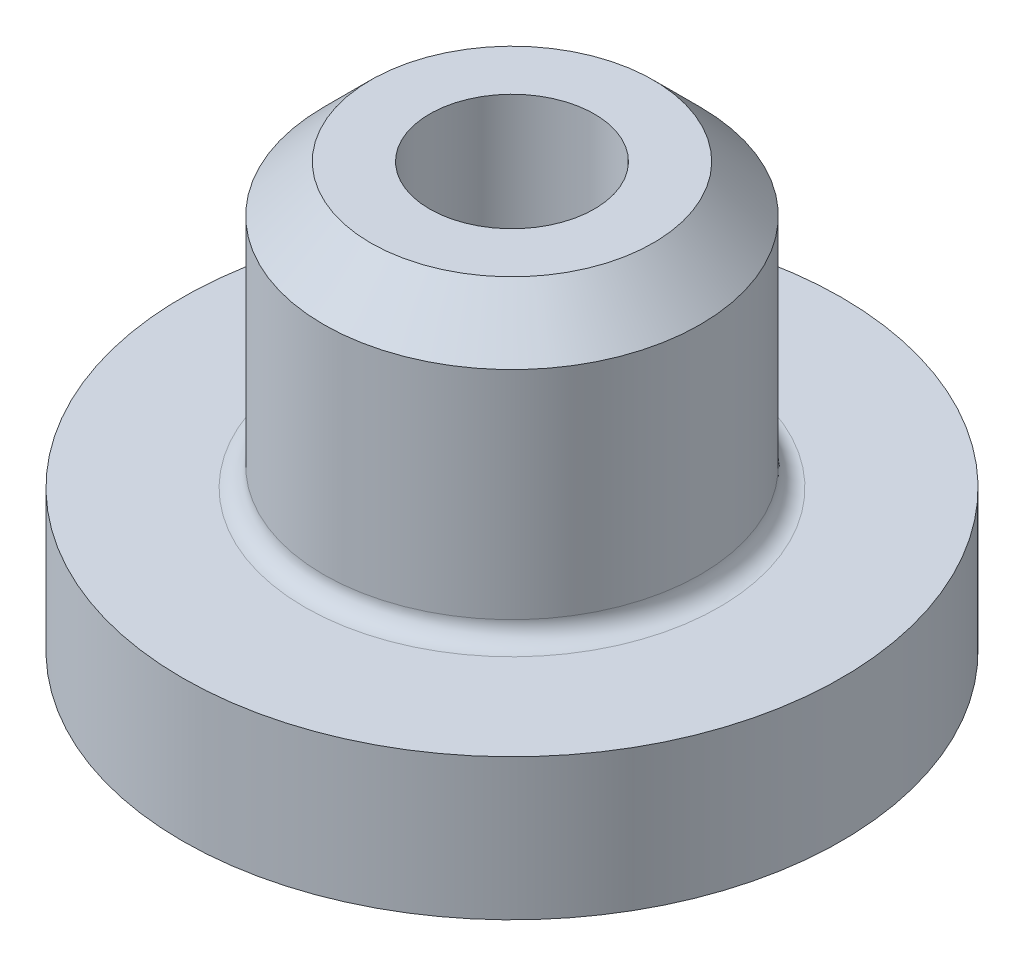
ISO-10303-21;
HEADER;
FILE_DESCRIPTION(('STEP AP214'),'2;1');
FILE_NAME('part.step','',(''),(''),'','','');
FILE_SCHEMA(('AUTOMOTIVE_DESIGN { 1 0 10303 214 1 1 1 1 }'));
ENDSEC;
DATA;
#1=APPLICATION_CONTEXT('core data for automotive mechanical design processes');
#2=APPLICATION_PROTOCOL_DEFINITION('international standard','automotive_design',2000,#1);
#3=PRODUCT_CONTEXT('',#1,'mechanical');
#4=PRODUCT('Part','Part','',(#3));
#5=PRODUCT_RELATED_PRODUCT_CATEGORY('part','',(#4));
#6=PRODUCT_DEFINITION_FORMATION('','',#4);
#7=PRODUCT_DEFINITION_CONTEXT('part definition',#1,'design');
#8=PRODUCT_DEFINITION('design','',#6,#7);
#9=PRODUCT_DEFINITION_SHAPE('','',#8);
#10=(LENGTH_UNIT() NAMED_UNIT(*) SI_UNIT(.MILLI.,.METRE.));
#11=(NAMED_UNIT(*) PLANE_ANGLE_UNIT() SI_UNIT($,.RADIAN.));
#12=(NAMED_UNIT(*) SI_UNIT($,.STERADIAN.) SOLID_ANGLE_UNIT());
#13=UNCERTAINTY_MEASURE_WITH_UNIT(LENGTH_MEASURE(1.E-05),#10,'distance_accuracy_value','');
#14=(GEOMETRIC_REPRESENTATION_CONTEXT(3) GLOBAL_UNCERTAINTY_ASSIGNED_CONTEXT((#13)) GLOBAL_UNIT_ASSIGNED_CONTEXT((#10,
#11,#12)) REPRESENTATION_CONTEXT('',''));
#15=CARTESIAN_POINT('',(0.,0.,0.));
#16=DIRECTION('',(0.,0.,1.));
#17=DIRECTION('',(1.,0.,0.));
#18=AXIS2_PLACEMENT_3D('',#15,#16,#17);
#19=CARTESIAN_POINT('',(0.,2.,0.));
#20=DIRECTION('',(0.,-1.,0.));
#21=DIRECTION('',(0.,0.,-1.));
#22=AXIS2_PLACEMENT_3D('',#19,#20,#21);
#23=CYLINDRICAL_SURFACE('',#22,2.);
#24=CARTESIAN_POINT('',(0.,1.7,0.));
#25=DIRECTION('',(0.,1.,0.));
#26=DIRECTION('',(0.,0.,1.));
#27=AXIS2_PLACEMENT_3D('',#24,#25,#26);
#28=CIRCLE('',#27,2.);
#29=CARTESIAN_POINT('',(0.,1.7,2.));
#30=VERTEX_POINT('',#29);
#31=EDGE_CURVE('E56',#30,#30,#28,.T.);
#32=ORIENTED_EDGE('',*,*,#31,.T.);
#33=EDGE_LOOP('',(#32));
#34=FACE_BOUND('',#33,.T.);
#35=CARTESIAN_POINT('',(0.,4.,0.));
#36=DIRECTION('',(0.,1.,0.));
#37=DIRECTION('',(0.,0.,1.));
#38=AXIS2_PLACEMENT_3D('',#35,#36,#37);
#39=CIRCLE('',#38,2.);
#40=CARTESIAN_POINT('',(0.,4.,2.));
#41=VERTEX_POINT('',#40);
#42=EDGE_CURVE('E65',#41,#41,#39,.F.);
#43=ORIENTED_EDGE('',*,*,#42,.T.);
#44=EDGE_LOOP('',(#43));
#45=FACE_BOUND('',#44,.T.);
#46=ADVANCED_FACE('F36',(#34,#45),#23,.T.);
#47=CARTESIAN_POINT('',(3.5,1.5,0.));
#48=DIRECTION('',(0.,1.,0.));
#49=DIRECTION('',(0.,0.,1.));
#50=AXIS2_PLACEMENT_3D('',#47,#48,#49);
#51=PLANE('',#50);
#52=CARTESIAN_POINT('',(0.,1.5,0.));
#53=DIRECTION('',(0.,1.,0.));
#54=DIRECTION('',(0.,0.,1.));
#55=AXIS2_PLACEMENT_3D('',#52,#53,#54);
#56=CIRCLE('',#55,2.2);
#57=CARTESIAN_POINT('',(0.,1.5,2.2));
#58=VERTEX_POINT('',#57);
#59=EDGE_CURVE('E59',#58,#58,#56,.F.);
#60=ORIENTED_EDGE('',*,*,#59,.T.);
#61=EDGE_LOOP('',(#60));
#62=FACE_BOUND('',#61,.T.);
#63=CARTESIAN_POINT('',(0.,1.5,0.));
#64=DIRECTION('',(0.,-1.,0.));
#65=DIRECTION('',(0.,0.,-1.));
#66=AXIS2_PLACEMENT_3D('',#63,#64,#65);
#67=CIRCLE('',#66,3.5);
#68=CARTESIAN_POINT('',(0.,1.5,-3.5));
#69=VERTEX_POINT('',#68);
#70=EDGE_CURVE('E68',#69,#69,#67,.T.);
#71=ORIENTED_EDGE('',*,*,#70,.F.);
#72=EDGE_LOOP('',(#71));
#73=FACE_BOUND('',#72,.T.);
#74=ADVANCED_FACE('F98',(#62,#73),#51,.T.);
#75=CARTESIAN_POINT('',(0.,2.,0.));
#76=DIRECTION('',(0.,-1.,0.));
#77=DIRECTION('',(0.,0.,-1.));
#78=AXIS2_PLACEMENT_3D('',#75,#76,#77);
#79=CYLINDRICAL_SURFACE('',#78,3.5);
#80=ORIENTED_EDGE('',*,*,#70,.T.);
#81=EDGE_LOOP('',(#80));
#82=FACE_BOUND('',#81,.T.);
#83=CARTESIAN_POINT('',(0.,0.,0.));
#84=DIRECTION('',(0.,-1.,0.));
#85=DIRECTION('',(0.,0.,-1.));
#86=AXIS2_PLACEMENT_3D('',#83,#84,#85);
#87=CIRCLE('',#86,3.5);
#88=CARTESIAN_POINT('',(0.,0.,-3.5));
#89=VERTEX_POINT('',#88);
#90=EDGE_CURVE('E71',#89,#89,#87,.T.);
#91=ORIENTED_EDGE('',*,*,#90,.F.);
#92=EDGE_LOOP('',(#91));
#93=FACE_BOUND('',#92,.T.);
#94=ADVANCED_FACE('F104',(#82,#93),#79,.T.);
#95=CARTESIAN_POINT('',(3.5,0.,0.));
#96=DIRECTION('',(0.,-1.,0.));
#97=DIRECTION('',(0.,0.,-1.));
#98=AXIS2_PLACEMENT_3D('',#95,#96,#97);
#99=PLANE('',#98);
#100=ORIENTED_EDGE('',*,*,#90,.T.);
#101=EDGE_LOOP('',(#100));
#102=FACE_BOUND('',#101,.T.);
#103=CARTESIAN_POINT('',(0.,0.,0.));
#104=DIRECTION('',(0.,-1.,0.));
#105=DIRECTION('',(0.,0.,-1.));
#106=AXIS2_PLACEMENT_3D('',#103,#104,#105);
#107=CIRCLE('',#106,1.2);
#108=CARTESIAN_POINT('',(0.,0.,-1.2));
#109=VERTEX_POINT('',#108);
#110=EDGE_CURVE('E74',#109,#109,#107,.T.);
#111=ORIENTED_EDGE('',*,*,#110,.F.);
#112=EDGE_LOOP('',(#111));
#113=FACE_BOUND('',#112,.T.);
#114=ADVANCED_FACE('F133',(#102,#113),#99,.T.);
#115=CARTESIAN_POINT('',(0.,2.,0.));
#116=DIRECTION('',(0.,-1.,0.));
#117=DIRECTION('',(0.,0.,-1.));
#118=AXIS2_PLACEMENT_3D('',#115,#116,#117);
#119=CYLINDRICAL_SURFACE('',#118,1.2);
#120=CARTESIAN_POINT('',(0.,1.8,0.));
#121=DIRECTION('',(0.,-1.,0.));
#122=DIRECTION('',(0.,0.,-1.));
#123=AXIS2_PLACEMENT_3D('',#120,#121,#122);
#124=CIRCLE('',#123,1.2);
#125=CARTESIAN_POINT('',(0.,1.8,-1.2));
#126=VERTEX_POINT('',#125);
#127=EDGE_CURVE('E47',#126,#126,#124,.F.);
#128=ORIENTED_EDGE('',*,*,#127,.T.);
#129=EDGE_LOOP('',(#128));
#130=FACE_BOUND('',#129,.T.);
#131=ORIENTED_EDGE('',*,*,#110,.T.);
#132=EDGE_LOOP('',(#131));
#133=FACE_BOUND('',#132,.T.);
#134=ADVANCED_FACE('F94',(#130,#133),#119,.F.);
#135=CARTESIAN_POINT('',(1.2,2.,0.));
#136=DIRECTION('',(0.,-1.,0.));
#137=DIRECTION('',(0.,0.,-1.));
#138=AXIS2_PLACEMENT_3D('',#135,#136,#137);
#139=PLANE('',#138);
#140=CARTESIAN_POINT('',(0.,2.,0.));
#141=DIRECTION('',(0.,-1.,0.));
#142=DIRECTION('',(0.,0.,-1.));
#143=AXIS2_PLACEMENT_3D('',#140,#141,#142);
#144=CIRCLE('',#143,1.);
#145=CARTESIAN_POINT('',(0.,2.,-1.));
#146=VERTEX_POINT('',#145);
#147=EDGE_CURVE('E51',#146,#146,#144,.T.);
#148=ORIENTED_EDGE('',*,*,#147,.T.);
#149=EDGE_LOOP('',(#148));
#150=FACE_BOUND('',#149,.T.);
#151=ADVANCED_FACE('F85',(#150),#139,.T.);
#152=CARTESIAN_POINT('',(0.,4.5,0.));
#153=DIRECTION('',(0.,1.,0.));
#154=DIRECTION('',(0.,0.,1.));
#155=AXIS2_PLACEMENT_3D('',#152,#153,#154);
#156=PLANE('',#155);
#157=CARTESIAN_POINT('',(0.,4.5,0.));
#158=DIRECTION('',(0.,1.,0.));
#159=DIRECTION('',(0.,0.,1.));
#160=AXIS2_PLACEMENT_3D('',#157,#158,#159);
#161=CIRCLE('',#160,1.5);
#162=CARTESIAN_POINT('',(0.,4.5,1.5));
#163=VERTEX_POINT('',#162);
#164=EDGE_CURVE('E62',#163,#163,#161,.T.);
#165=ORIENTED_EDGE('',*,*,#164,.T.);
#166=EDGE_LOOP('',(#165));
#167=FACE_BOUND('',#166,.T.);
#168=CARTESIAN_POINT('',(0.,4.5,0.));
#169=DIRECTION('',(0.,1.,0.));
#170=DIRECTION('',(0.,0.,1.));
#171=AXIS2_PLACEMENT_3D('',#168,#169,#170);
#172=CIRCLE('',#171,0.875);
#173=CARTESIAN_POINT('',(0.,4.5,0.875));
#174=VERTEX_POINT('',#173);
#175=EDGE_CURVE('E77',#174,#174,#172,.T.);
#176=ORIENTED_EDGE('',*,*,#175,.F.);
#177=EDGE_LOOP('',(#176));
#178=FACE_BOUND('',#177,.T.);
#179=ADVANCED_FACE('F83',(#167,#178),#156,.T.);
#180=CARTESIAN_POINT('',(0.,2.5,0.));
#181=DIRECTION('',(0.,1.,0.));
#182=DIRECTION('',(0.,0.,1.));
#183=AXIS2_PLACEMENT_3D('',#180,#181,#182);
#184=CYLINDRICAL_SURFACE('',#183,0.875);
#185=CARTESIAN_POINT('',(0.,2.7,0.));
#186=DIRECTION('',(0.,1.,0.));
#187=DIRECTION('',(0.,0.,1.));
#188=AXIS2_PLACEMENT_3D('',#185,#186,#187);
#189=CIRCLE('',#188,0.875);
#190=CARTESIAN_POINT('',(0.,2.7,0.875));
#191=VERTEX_POINT('',#190);
#192=EDGE_CURVE('E10',#191,#191,#189,.F.);
#193=ORIENTED_EDGE('',*,*,#192,.T.);
#194=EDGE_LOOP('',(#193));
#195=FACE_BOUND('',#194,.T.);
#196=ORIENTED_EDGE('',*,*,#175,.T.);
#197=EDGE_LOOP('',(#196));
#198=FACE_BOUND('',#197,.T.);
#199=ADVANCED_FACE('F81',(#195,#198),#184,.F.);
#200=CARTESIAN_POINT('',(0.,2.5,0.));
#201=DIRECTION('',(0.,1.,0.));
#202=DIRECTION('',(0.,0.,1.));
#203=AXIS2_PLACEMENT_3D('',#200,#201,#202);
#204=PLANE('',#203);
#205=CARTESIAN_POINT('',(0.,2.5,0.));
#206=DIRECTION('',(0.,1.,0.));
#207=DIRECTION('',(0.,0.,1.));
#208=AXIS2_PLACEMENT_3D('',#205,#206,#207);
#209=CIRCLE('',#208,0.675);
#210=CARTESIAN_POINT('',(0.,2.5,0.675));
#211=VERTEX_POINT('',#210);
#212=EDGE_CURVE('E43',#211,#211,#209,.T.);
#213=ORIENTED_EDGE('',*,*,#212,.T.);
#214=EDGE_LOOP('',(#213));
#215=FACE_BOUND('',#214,.T.);
#216=ADVANCED_FACE('F92',(#215),#204,.T.);
#217=CARTESIAN_POINT('',(0.,4.,0.));
#218=DIRECTION('',(0.,-1.,0.));
#219=DIRECTION('',(0.,0.,-1.));
#220=AXIS2_PLACEMENT_3D('',#217,#218,#219);
#221=CONICAL_SURFACE('',#220,2.,0.78539816339745);
#222=ORIENTED_EDGE('',*,*,#164,.F.);
#223=EDGE_LOOP('',(#222));
#224=FACE_BOUND('',#223,.T.);
#225=ORIENTED_EDGE('',*,*,#42,.F.);
#226=EDGE_LOOP('',(#225));
#227=FACE_BOUND('',#226,.T.);
#228=ADVANCED_FACE('F111',(#224,#227),#221,.T.);
#229=CARTESIAN_POINT('',(0.,1.7,0.));
#230=DIRECTION('',(0.,1.,0.));
#231=DIRECTION('',(0.,0.,1.));
#232=AXIS2_PLACEMENT_3D('',#229,#230,#231);
#233=TOROIDAL_SURFACE('',#232,2.2,0.2);
#234=ORIENTED_EDGE('',*,*,#31,.F.);
#235=EDGE_LOOP('',(#234));
#236=FACE_BOUND('',#235,.T.);
#237=ORIENTED_EDGE('',*,*,#59,.F.);
#238=EDGE_LOOP('',(#237));
#239=FACE_BOUND('',#238,.T.);
#240=ADVANCED_FACE('F116',(#236,#239),#233,.F.);
#241=CARTESIAN_POINT('',(0.,1.8,0.));
#242=DIRECTION('',(0.,-1.,0.));
#243=DIRECTION('',(0.,0.,-1.));
#244=AXIS2_PLACEMENT_3D('',#241,#242,#243);
#245=TOROIDAL_SURFACE('',#244,1.,0.2);
#246=ORIENTED_EDGE('',*,*,#127,.F.);
#247=EDGE_LOOP('',(#246));
#248=FACE_BOUND('',#247,.T.);
#249=ORIENTED_EDGE('',*,*,#147,.F.);
#250=EDGE_LOOP('',(#249));
#251=FACE_BOUND('',#250,.T.);
#252=ADVANCED_FACE('F119',(#248,#251),#245,.F.);
#253=CARTESIAN_POINT('',(0.,2.7,0.));
#254=DIRECTION('',(0.,1.,0.));
#255=DIRECTION('',(0.,0.,1.));
#256=AXIS2_PLACEMENT_3D('',#253,#254,#255);
#257=TOROIDAL_SURFACE('',#256,0.675,0.2);
#258=ORIENTED_EDGE('',*,*,#192,.F.);
#259=EDGE_LOOP('',(#258));
#260=FACE_BOUND('',#259,.T.);
#261=ORIENTED_EDGE('',*,*,#212,.F.);
#262=EDGE_LOOP('',(#261));
#263=FACE_BOUND('',#262,.T.);
#264=ADVANCED_FACE('F38',(#260,#263),#257,.F.);
#265=CLOSED_SHELL('',(#46,#74,#94,#114,#134,#151,#179,#199,#216,#228,#240,#252,#264));
#266=MANIFOLD_SOLID_BREP('B2',#265);
#267=ADVANCED_BREP_SHAPE_REPRESENTATION('',(#18,#266),#14);
#268=SHAPE_DEFINITION_REPRESENTATION(#9,#267);
ENDSEC;
END-ISO-10303-21;
